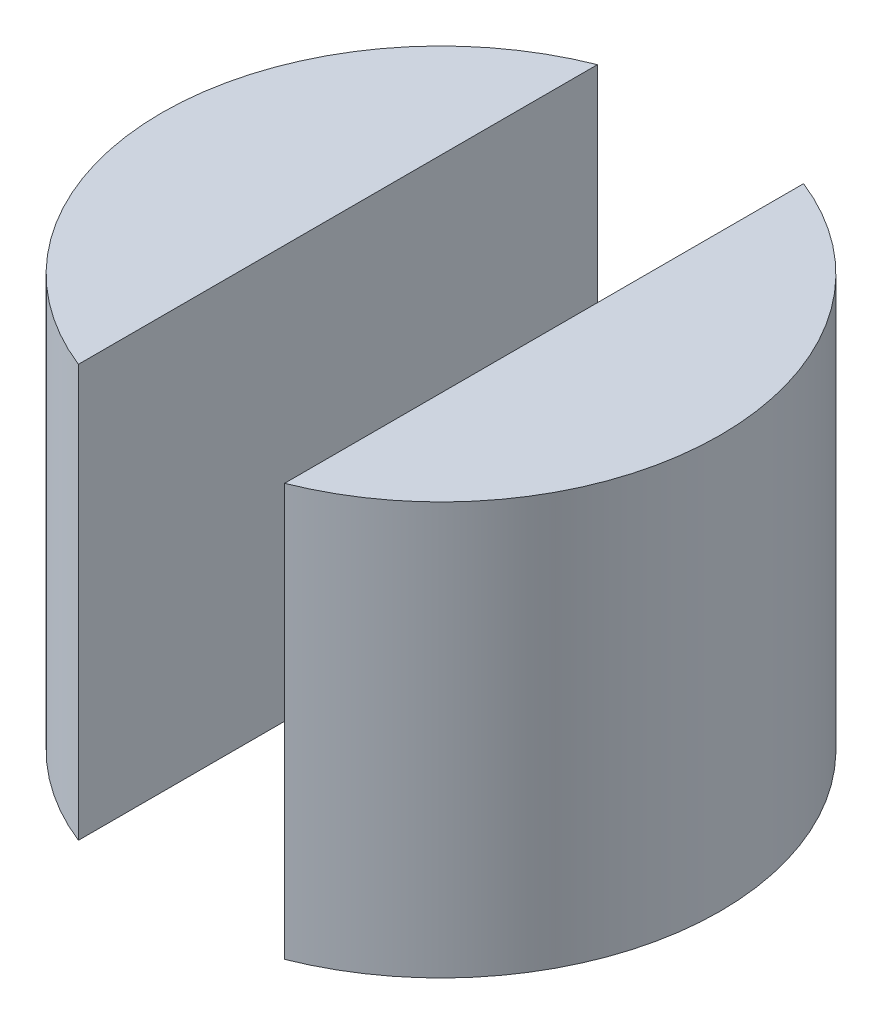
ISO-10303-21;
HEADER;
FILE_DESCRIPTION(('STEP AP214'),'2;1');
FILE_NAME('part.step','',(''),(''),'','','');
FILE_SCHEMA(('AUTOMOTIVE_DESIGN { 1 0 10303 214 1 1 1 1 }'));
ENDSEC;
DATA;
#1=APPLICATION_CONTEXT('core data for automotive mechanical design processes');
#2=APPLICATION_PROTOCOL_DEFINITION('international standard','automotive_design',2000,#1);
#3=PRODUCT_CONTEXT('',#1,'mechanical');
#4=PRODUCT('Part','Part','',(#3));
#5=PRODUCT_RELATED_PRODUCT_CATEGORY('part','',(#4));
#6=PRODUCT_DEFINITION_FORMATION('','',#4);
#7=PRODUCT_DEFINITION_CONTEXT('part definition',#1,'design');
#8=PRODUCT_DEFINITION('design','',#6,#7);
#9=PRODUCT_DEFINITION_SHAPE('','',#8);
#10=(LENGTH_UNIT() NAMED_UNIT(*) SI_UNIT(.MILLI.,.METRE.));
#11=(NAMED_UNIT(*) PLANE_ANGLE_UNIT() SI_UNIT($,.RADIAN.));
#12=(NAMED_UNIT(*) SI_UNIT($,.STERADIAN.) SOLID_ANGLE_UNIT());
#13=UNCERTAINTY_MEASURE_WITH_UNIT(LENGTH_MEASURE(1.E-05),#10,'distance_accuracy_value','');
#14=(GEOMETRIC_REPRESENTATION_CONTEXT(3) GLOBAL_UNCERTAINTY_ASSIGNED_CONTEXT((#13)) GLOBAL_UNIT_ASSIGNED_CONTEXT((#10,
#11,#12)) REPRESENTATION_CONTEXT('',''));
#15=CARTESIAN_POINT('',(0.,0.,0.));
#16=DIRECTION('',(0.,0.,1.));
#17=DIRECTION('',(1.,0.,0.));
#18=AXIS2_PLACEMENT_3D('',#15,#16,#17);
#19=CARTESIAN_POINT('',(0.,6.,0.));
#20=DIRECTION('',(0.,-1.,0.));
#21=DIRECTION('',(0.,0.,-1.));
#22=AXIS2_PLACEMENT_3D('',#19,#20,#21);
#23=CYLINDRICAL_SURFACE('',#22,4.06397996585768);
#24=CARTESIAN_POINT('',(0.,0.,0.));
#25=DIRECTION('',(0.,1.,0.));
#26=DIRECTION('',(0.,0.,1.));
#27=AXIS2_PLACEMENT_3D('',#24,#25,#26);
#28=CIRCLE('',#27,4.06397996585768);
#29=CARTESIAN_POINT('',(1.5,0.,3.77702702702703));
#30=VERTEX_POINT('',#29);
#31=CARTESIAN_POINT('',(1.5,0.,-3.77702702702703));
#32=VERTEX_POINT('',#31);
#33=EDGE_CURVE('E74',#30,#32,#28,.T.);
#34=ORIENTED_EDGE('',*,*,#33,.T.);
#35=DIRECTION('',(0.,-1.,0.));
#36=VECTOR('',#35,1.);
#37=CARTESIAN_POINT('',(1.5,6.,-3.77702702702703));
#38=LINE('',#37,#36);
#39=CARTESIAN_POINT('',(1.5,6.,-3.77702702702703));
#40=VERTEX_POINT('',#39);
#41=EDGE_CURVE('E12',#40,#32,#38,.T.);
#42=ORIENTED_EDGE('',*,*,#41,.F.);
#43=CARTESIAN_POINT('',(0.,6.,0.));
#44=DIRECTION('',(0.,1.,0.));
#45=DIRECTION('',(0.,0.,1.));
#46=AXIS2_PLACEMENT_3D('',#43,#44,#45);
#47=CIRCLE('',#46,4.06397996585768);
#48=CARTESIAN_POINT('',(1.5,6.,3.77702702702703));
#49=VERTEX_POINT('',#48);
#50=EDGE_CURVE('E73',#49,#40,#47,.T.);
#51=ORIENTED_EDGE('',*,*,#50,.F.);
#52=DIRECTION('',(0.,-1.,0.));
#53=VECTOR('',#52,1.);
#54=CARTESIAN_POINT('',(1.5,6.,3.77702702702703));
#55=LINE('',#54,#53);
#56=EDGE_CURVE('E51',#49,#30,#55,.T.);
#57=ORIENTED_EDGE('',*,*,#56,.T.);
#58=EDGE_LOOP('',(#34,#42,#51,#57));
#59=FACE_BOUND('',#58,.T.);
#60=ADVANCED_FACE('F43',(#59),#23,.T.);
#61=CARTESIAN_POINT('',(1.5,6.,-3.77702702702703));
#62=DIRECTION('',(1.,0.,0.));
#63=DIRECTION('',(0.,0.,-1.));
#64=AXIS2_PLACEMENT_3D('',#61,#62,#63);
#65=PLANE('',#64);
#66=DIRECTION('',(0.,0.,1.));
#67=VECTOR('',#66,1.);
#68=CARTESIAN_POINT('',(1.5,0.,-3.77702702702703));
#69=LINE('',#68,#67);
#70=EDGE_CURVE('E66',#32,#30,#69,.T.);
#71=ORIENTED_EDGE('',*,*,#70,.T.);
#72=ORIENTED_EDGE('',*,*,#56,.F.);
#73=DIRECTION('',(0.,0.,1.));
#74=VECTOR('',#73,1.);
#75=CARTESIAN_POINT('',(1.5,6.,-3.77702702702703));
#76=LINE('',#75,#74);
#77=EDGE_CURVE('E58',#40,#49,#76,.T.);
#78=ORIENTED_EDGE('',*,*,#77,.F.);
#79=ORIENTED_EDGE('',*,*,#41,.T.);
#80=EDGE_LOOP('',(#71,#72,#78,#79));
#81=FACE_BOUND('',#80,.T.);
#82=ADVANCED_FACE('F69',(#81),#65,.F.);
#83=CARTESIAN_POINT('',(0.,6.,0.));
#84=DIRECTION('',(0.,1.,0.));
#85=DIRECTION('',(0.,0.,1.));
#86=AXIS2_PLACEMENT_3D('',#83,#84,#85);
#87=PLANE('',#86);
#88=ORIENTED_EDGE('',*,*,#50,.T.);
#89=ORIENTED_EDGE('',*,*,#77,.T.);
#90=EDGE_LOOP('',(#88,#89));
#91=FACE_BOUND('',#90,.T.);
#92=ADVANCED_FACE('F81',(#91),#87,.T.);
#93=CARTESIAN_POINT('',(0.,0.,0.));
#94=DIRECTION('',(0.,1.,0.));
#95=DIRECTION('',(0.,0.,1.));
#96=AXIS2_PLACEMENT_3D('',#93,#94,#95);
#97=PLANE('',#96);
#98=ORIENTED_EDGE('',*,*,#33,.F.);
#99=ORIENTED_EDGE('',*,*,#70,.F.);
#100=EDGE_LOOP('',(#98,#99));
#101=FACE_BOUND('',#100,.T.);
#102=ADVANCED_FACE('F77',(#101),#97,.F.);
#103=CLOSED_SHELL('',(#60,#82,#92,#102));
#104=MANIFOLD_SOLID_BREP('B2',#103);
#105=CARTESIAN_POINT('',(0.,6.,0.));
#106=DIRECTION('',(0.,-1.,0.));
#107=DIRECTION('',(0.,0.,-1.));
#108=AXIS2_PLACEMENT_3D('',#105,#106,#107);
#109=CYLINDRICAL_SURFACE('',#108,4.06397996585768);
#110=CARTESIAN_POINT('',(0.,0.,0.));
#111=DIRECTION('',(0.,1.,0.));
#112=DIRECTION('',(0.,0.,1.));
#113=AXIS2_PLACEMENT_3D('',#110,#111,#112);
#114=CIRCLE('',#113,4.06397996585768);
#115=CARTESIAN_POINT('',(-1.5,0.,-3.77702702702703));
#116=VERTEX_POINT('',#115);
#117=CARTESIAN_POINT('',(-1.5,0.,3.77702702702703));
#118=VERTEX_POINT('',#117);
#119=EDGE_CURVE('E146',#116,#118,#114,.T.);
#120=ORIENTED_EDGE('',*,*,#119,.T.);
#121=DIRECTION('',(0.,-1.,0.));
#122=VECTOR('',#121,1.);
#123=CARTESIAN_POINT('',(-1.5,6.,3.77702702702703));
#124=LINE('',#123,#122);
#125=CARTESIAN_POINT('',(-1.5,6.,3.77702702702703));
#126=VERTEX_POINT('',#125);
#127=EDGE_CURVE('E41',#126,#118,#124,.T.);
#128=ORIENTED_EDGE('',*,*,#127,.F.);
#129=CARTESIAN_POINT('',(0.,6.,0.));
#130=DIRECTION('',(0.,1.,0.));
#131=DIRECTION('',(0.,0.,1.));
#132=AXIS2_PLACEMENT_3D('',#129,#130,#131);
#133=CIRCLE('',#132,4.06397996585768);
#134=CARTESIAN_POINT('',(-1.5,6.,-3.77702702702703));
#135=VERTEX_POINT('',#134);
#136=EDGE_CURVE('E145',#135,#126,#133,.T.);
#137=ORIENTED_EDGE('',*,*,#136,.F.);
#138=DIRECTION('',(0.,-1.,0.));
#139=VECTOR('',#138,1.);
#140=CARTESIAN_POINT('',(-1.5,6.,-3.77702702702703));
#141=LINE('',#140,#139);
#142=EDGE_CURVE('E123',#135,#116,#141,.T.);
#143=ORIENTED_EDGE('',*,*,#142,.T.);
#144=EDGE_LOOP('',(#120,#128,#137,#143));
#145=FACE_BOUND('',#144,.T.);
#146=ADVANCED_FACE('F115',(#145),#109,.T.);
#147=CARTESIAN_POINT('',(-1.5,6.,-3.77702702702703));
#148=DIRECTION('',(-1.,0.,0.));
#149=DIRECTION('',(0.,0.,1.));
#150=AXIS2_PLACEMENT_3D('',#147,#148,#149);
#151=PLANE('',#150);
#152=DIRECTION('',(0.,0.,-1.));
#153=VECTOR('',#152,1.);
#154=CARTESIAN_POINT('',(-1.5,0.,-3.77702702702703));
#155=LINE('',#154,#153);
#156=EDGE_CURVE('E138',#118,#116,#155,.T.);
#157=ORIENTED_EDGE('',*,*,#156,.T.);
#158=ORIENTED_EDGE('',*,*,#142,.F.);
#159=DIRECTION('',(0.,0.,-1.));
#160=VECTOR('',#159,1.);
#161=CARTESIAN_POINT('',(-1.5,6.,-3.77702702702703));
#162=LINE('',#161,#160);
#163=EDGE_CURVE('E130',#126,#135,#162,.T.);
#164=ORIENTED_EDGE('',*,*,#163,.F.);
#165=ORIENTED_EDGE('',*,*,#127,.T.);
#166=EDGE_LOOP('',(#157,#158,#164,#165));
#167=FACE_BOUND('',#166,.T.);
#168=ADVANCED_FACE('F141',(#167),#151,.F.);
#169=CARTESIAN_POINT('',(0.,6.,0.));
#170=DIRECTION('',(0.,1.,0.));
#171=DIRECTION('',(0.,0.,1.));
#172=AXIS2_PLACEMENT_3D('',#169,#170,#171);
#173=PLANE('',#172);
#174=ORIENTED_EDGE('',*,*,#136,.T.);
#175=ORIENTED_EDGE('',*,*,#163,.T.);
#176=EDGE_LOOP('',(#174,#175));
#177=FACE_BOUND('',#176,.T.);
#178=ADVANCED_FACE('F153',(#177),#173,.T.);
#179=CARTESIAN_POINT('',(0.,0.,0.));
#180=DIRECTION('',(0.,1.,0.));
#181=DIRECTION('',(0.,0.,1.));
#182=AXIS2_PLACEMENT_3D('',#179,#180,#181);
#183=PLANE('',#182);
#184=ORIENTED_EDGE('',*,*,#119,.F.);
#185=ORIENTED_EDGE('',*,*,#156,.F.);
#186=EDGE_LOOP('',(#184,#185));
#187=FACE_BOUND('',#186,.T.);
#188=ADVANCED_FACE('F149',(#187),#183,.F.);
#189=CLOSED_SHELL('',(#146,#168,#178,#188));
#190=MANIFOLD_SOLID_BREP('B6',#189);
#191=ADVANCED_BREP_SHAPE_REPRESENTATION('',(#18,#104,#190),#14);
#192=SHAPE_DEFINITION_REPRESENTATION(#9,#191);
ENDSEC;
END-ISO-10303-21;
